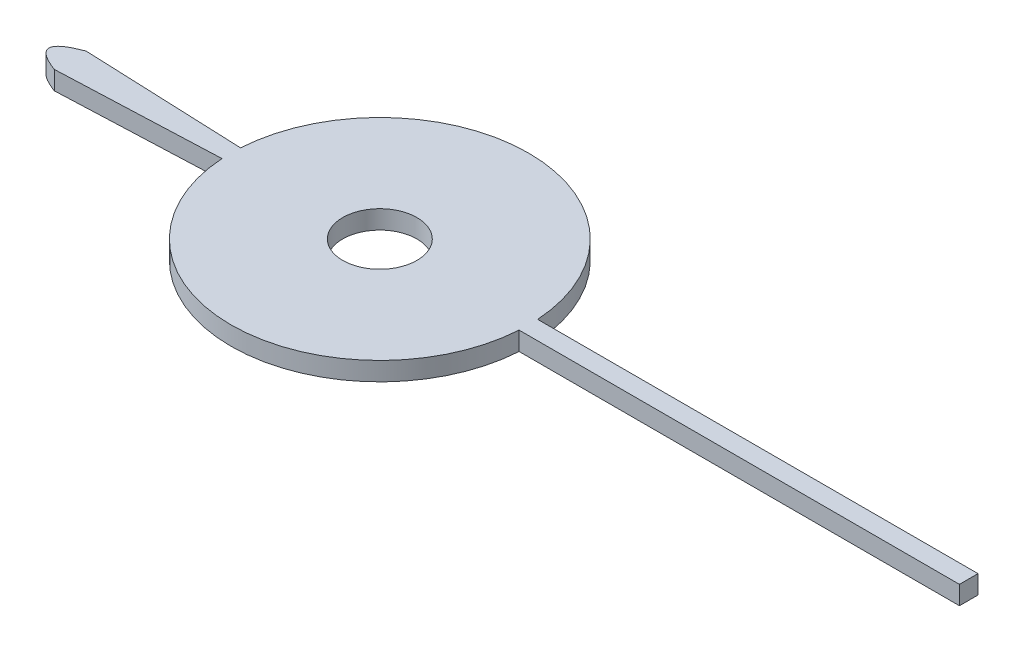
ISO-10303-21;
HEADER;
FILE_DESCRIPTION(('STEP AP214'),'2;1');
FILE_NAME('part.step','',(''),(''),'','','');
FILE_SCHEMA(('AUTOMOTIVE_DESIGN { 1 0 10303 214 1 1 1 1 }'));
ENDSEC;
DATA;
#1=APPLICATION_CONTEXT('core data for automotive mechanical design processes');
#2=APPLICATION_PROTOCOL_DEFINITION('international standard','automotive_design',2000,#1);
#3=PRODUCT_CONTEXT('',#1,'mechanical');
#4=PRODUCT('Part','Part','',(#3));
#5=PRODUCT_RELATED_PRODUCT_CATEGORY('part','',(#4));
#6=PRODUCT_DEFINITION_FORMATION('','',#4);
#7=PRODUCT_DEFINITION_CONTEXT('part definition',#1,'design');
#8=PRODUCT_DEFINITION('design','',#6,#7);
#9=PRODUCT_DEFINITION_SHAPE('','',#8);
#10=(LENGTH_UNIT() NAMED_UNIT(*) SI_UNIT(.MILLI.,.METRE.));
#11=(NAMED_UNIT(*) PLANE_ANGLE_UNIT() SI_UNIT($,.RADIAN.));
#12=(NAMED_UNIT(*) SI_UNIT($,.STERADIAN.) SOLID_ANGLE_UNIT());
#13=UNCERTAINTY_MEASURE_WITH_UNIT(LENGTH_MEASURE(1.E-05),#10,'distance_accuracy_value','');
#14=(GEOMETRIC_REPRESENTATION_CONTEXT(3) GLOBAL_UNCERTAINTY_ASSIGNED_CONTEXT((#13)) GLOBAL_UNIT_ASSIGNED_CONTEXT((#10,
#11,#12)) REPRESENTATION_CONTEXT('',''));
#15=CARTESIAN_POINT('',(0.,0.,0.));
#16=DIRECTION('',(0.,0.,1.));
#17=DIRECTION('',(1.,0.,0.));
#18=AXIS2_PLACEMENT_3D('',#15,#16,#17);
#19=CARTESIAN_POINT('',(0.,0.5,-0.25));
#20=DIRECTION('',(0.,0.,-1.));
#21=DIRECTION('',(-1.,0.,0.));
#22=AXIS2_PLACEMENT_3D('',#19,#20,#21);
#23=PLANE('',#22);
#24=DIRECTION('',(1.,0.,0.));
#25=VECTOR('',#24,1.);
#26=CARTESIAN_POINT('',(0.,0.,-0.25));
#27=LINE('',#26,#25);
#28=CARTESIAN_POINT('',(4.,0.,-0.25));
#29=VERTEX_POINT('',#28);
#30=CARTESIAN_POINT('',(15.8593426871932,0.,-0.25));
#31=VERTEX_POINT('',#30);
#32=EDGE_CURVE('E132',#29,#31,#27,.T.);
#33=ORIENTED_EDGE('',*,*,#32,.F.);
#34=DIRECTION('',(0.,-1.,0.));
#35=VECTOR('',#34,1.);
#36=CARTESIAN_POINT('',(4.,0.5,-0.25));
#37=LINE('',#36,#35);
#38=CARTESIAN_POINT('',(4.,0.5,-0.25));
#39=VERTEX_POINT('',#38);
#40=EDGE_CURVE('E11',#39,#29,#37,.T.);
#41=ORIENTED_EDGE('',*,*,#40,.F.);
#42=DIRECTION('',(1.,0.,0.));
#43=VECTOR('',#42,1.);
#44=CARTESIAN_POINT('',(0.,0.5,-0.25));
#45=LINE('',#44,#43);
#46=CARTESIAN_POINT('',(15.8593426871932,0.5,-0.25));
#47=VERTEX_POINT('',#46);
#48=EDGE_CURVE('E155',#39,#47,#45,.T.);
#49=ORIENTED_EDGE('',*,*,#48,.T.);
#50=DIRECTION('',(0.,-1.,0.));
#51=VECTOR('',#50,1.);
#52=CARTESIAN_POINT('',(15.8593426871932,0.5,-0.25));
#53=LINE('',#52,#51);
#54=EDGE_CURVE('E52',#47,#31,#53,.T.);
#55=ORIENTED_EDGE('',*,*,#54,.T.);
#56=EDGE_LOOP('',(#33,#41,#49,#55));
#57=FACE_BOUND('',#56,.T.);
#58=ADVANCED_FACE('F36',(#57),#23,.T.);
#59=CARTESIAN_POINT('',(0.,0.5,0.));
#60=DIRECTION('',(0.,-1.,0.));
#61=DIRECTION('',(0.,0.,-1.));
#62=AXIS2_PLACEMENT_3D('',#59,#60,#61);
#63=CYLINDRICAL_SURFACE('',#62,4.00780488547035);
#64=CARTESIAN_POINT('',(0.,0.,0.));
#65=DIRECTION('',(0.,1.,0.));
#66=DIRECTION('',(0.,0.,1.));
#67=AXIS2_PLACEMENT_3D('',#64,#65,#66);
#68=CIRCLE('',#67,4.00780488547035);
#69=CARTESIAN_POINT('',(-4.,0.,-0.25));
#70=VERTEX_POINT('',#69);
#71=EDGE_CURVE('E134',#29,#70,#68,.T.);
#72=ORIENTED_EDGE('',*,*,#71,.T.);
#73=DIRECTION('',(0.,-1.,0.));
#74=VECTOR('',#73,1.);
#75=CARTESIAN_POINT('',(-4.,0.5,-0.25));
#76=LINE('',#75,#74);
#77=CARTESIAN_POINT('',(-4.,0.5,-0.25));
#78=VERTEX_POINT('',#77);
#79=EDGE_CURVE('E44',#78,#70,#76,.T.);
#80=ORIENTED_EDGE('',*,*,#79,.F.);
#81=CARTESIAN_POINT('',(0.,0.5,0.));
#82=DIRECTION('',(0.,1.,0.));
#83=DIRECTION('',(0.,0.,1.));
#84=AXIS2_PLACEMENT_3D('',#81,#82,#83);
#85=CIRCLE('',#84,4.00780488547035);
#86=EDGE_CURVE('E115',#39,#78,#85,.T.);
#87=ORIENTED_EDGE('',*,*,#86,.F.);
#88=ORIENTED_EDGE('',*,*,#40,.T.);
#89=EDGE_LOOP('',(#72,#80,#87,#88));
#90=FACE_BOUND('',#89,.T.);
#91=ADVANCED_FACE('F172',(#90),#63,.T.);
#92=CARTESIAN_POINT('',(0.00351580652269542,0.5,-0.0856374160691491));
#93=DIRECTION('',(0.0410200064252081,0.,-0.999158325328311));
#94=DIRECTION('',(-0.999158325328312,0.,-0.0410200064252081));
#95=AXIS2_PLACEMENT_3D('',#92,#93,#94);
#96=PLANE('',#95);
#97=DIRECTION('',(0.999158325328312,0.,0.0410200064252081));
#98=VECTOR('',#97,1.);
#99=CARTESIAN_POINT('',(0.00351580652269542,0.,-0.0856374160691491));
#100=LINE('',#99,#98);
#101=CARTESIAN_POINT('',(-8.33886799006442,0.,-0.428130320609689));
#102=VERTEX_POINT('',#101);
#103=EDGE_CURVE('E138',#102,#70,#100,.T.);
#104=ORIENTED_EDGE('',*,*,#103,.F.);
#105=DIRECTION('',(0.,-1.,0.));
#106=VECTOR('',#105,1.);
#107=CARTESIAN_POINT('',(-8.33886799006442,0.5,-0.428130320609689));
#108=LINE('',#107,#106);
#109=CARTESIAN_POINT('',(-8.33886799006442,0.5,-0.428130320609689));
#110=VERTEX_POINT('',#109);
#111=EDGE_CURVE('E162',#110,#102,#108,.T.);
#112=ORIENTED_EDGE('',*,*,#111,.F.);
#113=DIRECTION('',(0.999158325328312,0.,0.0410200064252081));
#114=VECTOR('',#113,1.);
#115=CARTESIAN_POINT('',(0.00351580652269542,0.5,-0.0856374160691491));
#116=LINE('',#115,#114);
#117=EDGE_CURVE('E169',#110,#78,#116,.T.);
#118=ORIENTED_EDGE('',*,*,#117,.T.);
#119=ORIENTED_EDGE('',*,*,#79,.T.);
#120=EDGE_LOOP('',(#104,#112,#118,#119));
#121=FACE_BOUND('',#120,.T.);
#122=ADVANCED_FACE('F167',(#121),#96,.T.);
#123=CARTESIAN_POINT('',(-8.33886799006442,0.5,-0.428130320609689));
#124=CARTESIAN_POINT('',(-9.48017140322199,0.5,0.));
#125=CARTESIAN_POINT('',(-8.33886799006442,0.5,0.428130320609689));
#126=B_SPLINE_CURVE_WITH_KNOTS('',2,(#123,#124,#125),.UNSPECIFIED.,.F.,.F.,(3,3),(0.,1.),.UNSPECIFIED.);
#127=DIRECTION('',(0.,-1.,0.));
#128=VECTOR('',#127,1.);
#129=SURFACE_OF_LINEAR_EXTRUSION('',#126,#128);
#130=CARTESIAN_POINT('',(-8.33886799006442,0.,-0.428130320609689));
#131=CARTESIAN_POINT('',(-9.48017140322199,0.,0.));
#132=CARTESIAN_POINT('',(-8.33886799006442,0.,0.428130320609689));
#133=B_SPLINE_CURVE_WITH_KNOTS('',2,(#130,#131,#132),.UNSPECIFIED.,.F.,.F.,(3,3),(0.,1.),.UNSPECIFIED.);
#134=CARTESIAN_POINT('',(-8.33886799006442,0.,0.428130320609689));
#135=VERTEX_POINT('',#134);
#136=EDGE_CURVE('E141',#102,#135,#133,.T.);
#137=ORIENTED_EDGE('',*,*,#136,.T.);
#138=DIRECTION('',(0.,-1.,0.));
#139=VECTOR('',#138,1.);
#140=CARTESIAN_POINT('',(-8.33886799006442,0.5,0.428130320609689));
#141=LINE('',#140,#139);
#142=CARTESIAN_POINT('',(-8.33886799006442,0.5,0.428130320609689));
#143=VERTEX_POINT('',#142);
#144=EDGE_CURVE('E159',#143,#135,#141,.T.);
#145=ORIENTED_EDGE('',*,*,#144,.F.);
#146=EDGE_CURVE('E183',#110,#143,#126,.T.);
#147=ORIENTED_EDGE('',*,*,#146,.F.);
#148=ORIENTED_EDGE('',*,*,#111,.T.);
#149=EDGE_LOOP('',(#137,#145,#147,#148));
#150=FACE_BOUND('',#149,.T.);
#151=ADVANCED_FACE('F179',(#150),#129,.F.);
#152=CARTESIAN_POINT('',(0.00351580652269542,0.5,0.0856374160691491));
#153=DIRECTION('',(-0.0410200064252081,0.,-0.999158325328311));
#154=DIRECTION('',(-0.999158325328312,0.,0.0410200064252081));
#155=AXIS2_PLACEMENT_3D('',#152,#153,#154);
#156=PLANE('',#155);
#157=DIRECTION('',(0.999158325328312,0.,-0.0410200064252081));
#158=VECTOR('',#157,1.);
#159=CARTESIAN_POINT('',(0.00351580652269542,0.,0.0856374160691491));
#160=LINE('',#159,#158);
#161=CARTESIAN_POINT('',(-4.,0.,0.25));
#162=VERTEX_POINT('',#161);
#163=EDGE_CURVE('E145',#135,#162,#160,.T.);
#164=ORIENTED_EDGE('',*,*,#163,.T.);
#165=DIRECTION('',(0.,-1.,0.));
#166=VECTOR('',#165,1.);
#167=CARTESIAN_POINT('',(-4.,0.5,0.25));
#168=LINE('',#167,#166);
#169=CARTESIAN_POINT('',(-4.,0.5,0.25));
#170=VERTEX_POINT('',#169);
#171=EDGE_CURVE('E123',#170,#162,#168,.T.);
#172=ORIENTED_EDGE('',*,*,#171,.F.);
#173=DIRECTION('',(0.999158325328312,0.,-0.0410200064252081));
#174=VECTOR('',#173,1.);
#175=CARTESIAN_POINT('',(0.00351580652269542,0.5,0.0856374160691491));
#176=LINE('',#175,#174);
#177=EDGE_CURVE('E110',#143,#170,#176,.T.);
#178=ORIENTED_EDGE('',*,*,#177,.F.);
#179=ORIENTED_EDGE('',*,*,#144,.T.);
#180=EDGE_LOOP('',(#164,#172,#178,#179));
#181=FACE_BOUND('',#180,.T.);
#182=ADVANCED_FACE('F182',(#181),#156,.F.);
#183=CARTESIAN_POINT('',(4.,0.,0.25));
#184=VERTEX_POINT('',#183);
#185=EDGE_CURVE('E120',#162,#184,#68,.T.);
#186=ORIENTED_EDGE('',*,*,#185,.T.);
#187=DIRECTION('',(0.,-1.,0.));
#188=VECTOR('',#187,1.);
#189=CARTESIAN_POINT('',(4.,0.5,0.25));
#190=LINE('',#189,#188);
#191=CARTESIAN_POINT('',(4.,0.5,0.25));
#192=VERTEX_POINT('',#191);
#193=EDGE_CURVE('E117',#192,#184,#190,.T.);
#194=ORIENTED_EDGE('',*,*,#193,.F.);
#195=EDGE_CURVE('E102',#170,#192,#85,.T.);
#196=ORIENTED_EDGE('',*,*,#195,.F.);
#197=ORIENTED_EDGE('',*,*,#171,.T.);
#198=EDGE_LOOP('',(#186,#194,#196,#197));
#199=FACE_BOUND('',#198,.T.);
#200=ADVANCED_FACE('F118',(#199),#63,.T.);
#201=CARTESIAN_POINT('',(0.,0.5,0.25));
#202=DIRECTION('',(0.,0.,-1.));
#203=DIRECTION('',(-1.,0.,0.));
#204=AXIS2_PLACEMENT_3D('',#201,#202,#203);
#205=PLANE('',#204);
#206=DIRECTION('',(1.,0.,0.));
#207=VECTOR('',#206,1.);
#208=CARTESIAN_POINT('',(0.,0.,0.25));
#209=LINE('',#208,#207);
#210=CARTESIAN_POINT('',(15.8593426871932,0.,0.25));
#211=VERTEX_POINT('',#210);
#212=EDGE_CURVE('E150',#184,#211,#209,.T.);
#213=ORIENTED_EDGE('',*,*,#212,.T.);
#214=DIRECTION('',(0.,-1.,0.));
#215=VECTOR('',#214,1.);
#216=CARTESIAN_POINT('',(15.8593426871932,0.5,0.25));
#217=LINE('',#216,#215);
#218=CARTESIAN_POINT('',(15.8593426871932,0.5,0.25));
#219=VERTEX_POINT('',#218);
#220=EDGE_CURVE('E78',#219,#211,#217,.T.);
#221=ORIENTED_EDGE('',*,*,#220,.F.);
#222=DIRECTION('',(1.,0.,0.));
#223=VECTOR('',#222,1.);
#224=CARTESIAN_POINT('',(0.,0.5,0.25));
#225=LINE('',#224,#223);
#226=EDGE_CURVE('E108',#192,#219,#225,.T.);
#227=ORIENTED_EDGE('',*,*,#226,.F.);
#228=ORIENTED_EDGE('',*,*,#193,.T.);
#229=EDGE_LOOP('',(#213,#221,#227,#228));
#230=FACE_BOUND('',#229,.T.);
#231=ADVANCED_FACE('F125',(#230),#205,.F.);
#232=CARTESIAN_POINT('',(15.8593426871932,0.5,0.));
#233=DIRECTION('',(1.,0.,0.));
#234=DIRECTION('',(0.,0.,-1.));
#235=AXIS2_PLACEMENT_3D('',#232,#233,#234);
#236=PLANE('',#235);
#237=DIRECTION('',(0.,0.,1.));
#238=VECTOR('',#237,1.);
#239=CARTESIAN_POINT('',(15.8593426871932,0.,0.));
#240=LINE('',#239,#238);
#241=EDGE_CURVE('E152',#31,#211,#240,.T.);
#242=ORIENTED_EDGE('',*,*,#241,.F.);
#243=ORIENTED_EDGE('',*,*,#54,.F.);
#244=DIRECTION('',(0.,0.,1.));
#245=VECTOR('',#244,1.);
#246=CARTESIAN_POINT('',(15.8593426871932,0.5,0.));
#247=LINE('',#246,#245);
#248=EDGE_CURVE('E126',#47,#219,#247,.T.);
#249=ORIENTED_EDGE('',*,*,#248,.T.);
#250=ORIENTED_EDGE('',*,*,#220,.T.);
#251=EDGE_LOOP('',(#242,#243,#249,#250));
#252=FACE_BOUND('',#251,.T.);
#253=ADVANCED_FACE('F202',(#252),#236,.T.);
#254=CARTESIAN_POINT('',(0.,0.5,0.));
#255=DIRECTION('',(0.,1.,0.));
#256=DIRECTION('',(0.,0.,1.));
#257=AXIS2_PLACEMENT_3D('',#254,#255,#256);
#258=PLANE('',#257);
#259=CARTESIAN_POINT('',(0.,0.5,0.));
#260=DIRECTION('',(0.,1.,0.));
#261=DIRECTION('',(0.,0.,1.));
#262=AXIS2_PLACEMENT_3D('',#259,#260,#261);
#263=CIRCLE('',#262,1.);
#264=CARTESIAN_POINT('',(0.,0.5,1.));
#265=VERTEX_POINT('',#264);
#266=EDGE_CURVE('E299',#265,#265,#263,.T.);
#267=ORIENTED_EDGE('',*,*,#266,.F.);
#268=EDGE_LOOP('',(#267));
#269=FACE_BOUND('',#268,.T.);
#270=ORIENTED_EDGE('',*,*,#48,.F.);
#271=ORIENTED_EDGE('',*,*,#86,.T.);
#272=ORIENTED_EDGE('',*,*,#117,.F.);
#273=ORIENTED_EDGE('',*,*,#146,.T.);
#274=ORIENTED_EDGE('',*,*,#177,.T.);
#275=ORIENTED_EDGE('',*,*,#195,.T.);
#276=ORIENTED_EDGE('',*,*,#226,.T.);
#277=ORIENTED_EDGE('',*,*,#248,.F.);
#278=EDGE_LOOP('',(#270,#271,#272,#273,#274,#275,#276,#277));
#279=FACE_BOUND('',#278,.T.);
#280=ADVANCED_FACE('F105',(#269,#279),#258,.T.);
#281=CARTESIAN_POINT('',(0.,0.,0.));
#282=DIRECTION('',(0.,1.,0.));
#283=DIRECTION('',(0.,0.,1.));
#284=AXIS2_PLACEMENT_3D('',#281,#282,#283);
#285=PLANE('',#284);
#286=CARTESIAN_POINT('',(0.,0.,0.));
#287=DIRECTION('',(0.,1.,0.));
#288=DIRECTION('',(0.,0.,1.));
#289=AXIS2_PLACEMENT_3D('',#286,#287,#288);
#290=CIRCLE('',#289,1.);
#291=CARTESIAN_POINT('',(0.,0.,1.));
#292=VERTEX_POINT('',#291);
#293=EDGE_CURVE('E135',#292,#292,#290,.T.);
#294=ORIENTED_EDGE('',*,*,#293,.T.);
#295=EDGE_LOOP('',(#294));
#296=FACE_BOUND('',#295,.T.);
#297=ORIENTED_EDGE('',*,*,#32,.T.);
#298=ORIENTED_EDGE('',*,*,#241,.T.);
#299=ORIENTED_EDGE('',*,*,#212,.F.);
#300=ORIENTED_EDGE('',*,*,#185,.F.);
#301=ORIENTED_EDGE('',*,*,#163,.F.);
#302=ORIENTED_EDGE('',*,*,#136,.F.);
#303=ORIENTED_EDGE('',*,*,#103,.T.);
#304=ORIENTED_EDGE('',*,*,#71,.F.);
#305=EDGE_LOOP('',(#297,#298,#299,#300,#301,#302,#303,#304));
#306=FACE_BOUND('',#305,.T.);
#307=ADVANCED_FACE('F175',(#296,#306),#285,.F.);
#308=CARTESIAN_POINT('',(0.,0.,0.));
#309=DIRECTION('',(0.,1.,0.));
#310=DIRECTION('',(0.,0.,1.));
#311=AXIS2_PLACEMENT_3D('',#308,#309,#310);
#312=CYLINDRICAL_SURFACE('',#311,1.);
#313=ORIENTED_EDGE('',*,*,#293,.F.);
#314=EDGE_LOOP('',(#313));
#315=FACE_BOUND('',#314,.T.);
#316=ORIENTED_EDGE('',*,*,#266,.T.);
#317=EDGE_LOOP('',(#316));
#318=FACE_BOUND('',#317,.T.);
#319=ADVANCED_FACE('F274',(#315,#318),#312,.F.);
#320=CLOSED_SHELL('',(#58,#91,#122,#151,#182,#200,#231,#253,#280,#307,#319));
#321=MANIFOLD_SOLID_BREP('B2',#320);
#322=ADVANCED_BREP_SHAPE_REPRESENTATION('',(#18,#321),#14);
#323=SHAPE_DEFINITION_REPRESENTATION(#9,#322);
ENDSEC;
END-ISO-10303-21;
